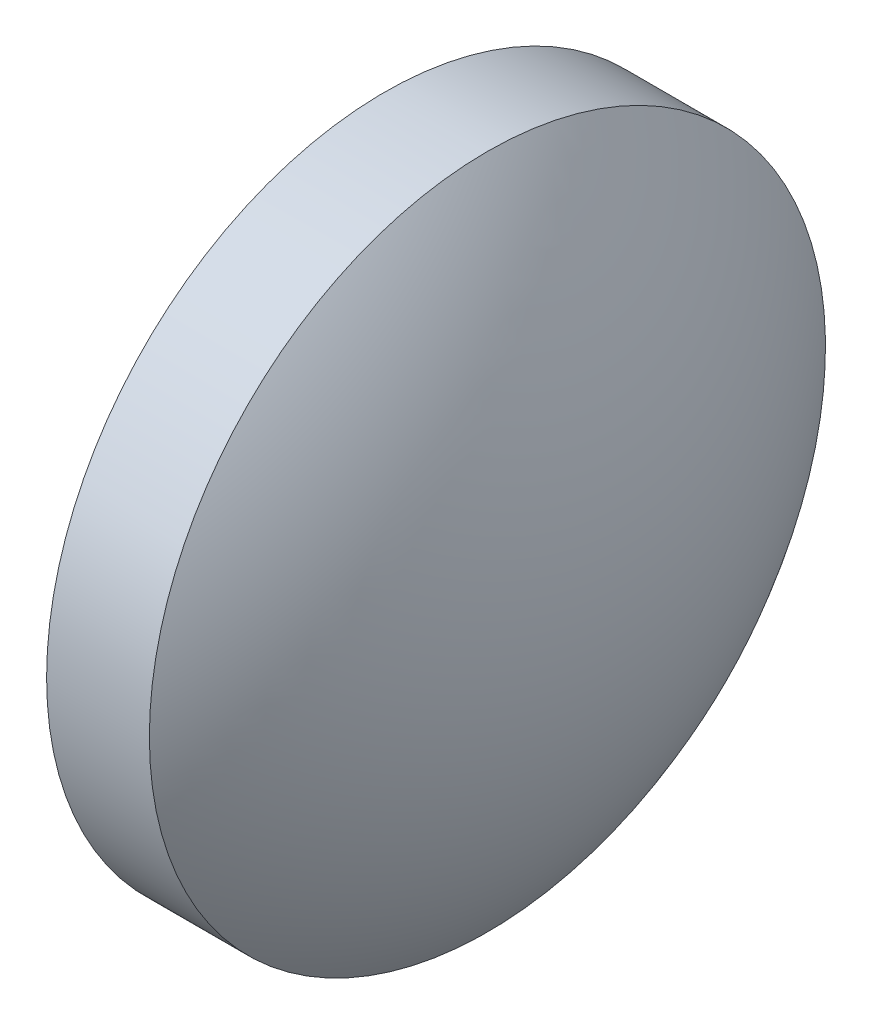
ISO-10303-21;
HEADER;
FILE_DESCRIPTION(('STEP AP214'),'2;1');
FILE_NAME('part.step','',(''),(''),'','','');
FILE_SCHEMA(('AUTOMOTIVE_DESIGN { 1 0 10303 214 1 1 1 1 }'));
ENDSEC;
DATA;
#1=APPLICATION_CONTEXT('core data for automotive mechanical design processes');
#2=APPLICATION_PROTOCOL_DEFINITION('international standard','automotive_design',2000,#1);
#3=PRODUCT_CONTEXT('',#1,'mechanical');
#4=PRODUCT('Part','Part','',(#3));
#5=PRODUCT_RELATED_PRODUCT_CATEGORY('part','',(#4));
#6=PRODUCT_DEFINITION_FORMATION('','',#4);
#7=PRODUCT_DEFINITION_CONTEXT('part definition',#1,'design');
#8=PRODUCT_DEFINITION('design','',#6,#7);
#9=PRODUCT_DEFINITION_SHAPE('','',#8);
#10=(LENGTH_UNIT() NAMED_UNIT(*) SI_UNIT(.MILLI.,.METRE.));
#11=(NAMED_UNIT(*) PLANE_ANGLE_UNIT() SI_UNIT($,.RADIAN.));
#12=(NAMED_UNIT(*) SI_UNIT($,.STERADIAN.) SOLID_ANGLE_UNIT());
#13=UNCERTAINTY_MEASURE_WITH_UNIT(LENGTH_MEASURE(1.E-05),#10,'distance_accuracy_value','');
#14=(GEOMETRIC_REPRESENTATION_CONTEXT(3) GLOBAL_UNCERTAINTY_ASSIGNED_CONTEXT((#13)) GLOBAL_UNIT_ASSIGNED_CONTEXT((#10,
#11,#12)) REPRESENTATION_CONTEXT('',''));
#15=CARTESIAN_POINT('',(0.,0.,0.));
#16=DIRECTION('',(0.,0.,1.));
#17=DIRECTION('',(1.,0.,0.));
#18=AXIS2_PLACEMENT_3D('',#15,#16,#17);
#19=CARTESIAN_POINT('',(548.627463267462,146.784706945377,0.));
#20=DIRECTION('',(-1.,0.,0.));
#21=DIRECTION('',(0.,1.,0.));
#22=AXIS2_PLACEMENT_3D('',#19,#20,#21);
#23=SPHERICAL_SURFACE('',#22,8.28047619047612);
#24=CARTESIAN_POINT('',(555.227939457938,146.784706945377,0.));
#25=DIRECTION('',(-1.,0.,0.));
#26=DIRECTION('',(0.,0.,1.));
#27=AXIS2_PLACEMENT_3D('',#24,#25,#26);
#28=CIRCLE('',#27,5.);
#29=CARTESIAN_POINT('',(555.227939457938,146.784706945377,5.));
#30=VERTEX_POINT('',#29);
#31=EDGE_CURVE('E10',#30,#30,#28,.T.);
#32=ORIENTED_EDGE('',*,*,#31,.F.);
#33=EDGE_LOOP('',(#32));
#34=FACE_BOUND('',#33,.T.);
#35=ADVANCED_FACE('F35',(#34),#23,.T.);
#36=CARTESIAN_POINT('',(552.766388986164,146.784706945377,0.));
#37=DIRECTION('',(-1.,0.,0.));
#38=DIRECTION('',(0.,0.,1.));
#39=AXIS2_PLACEMENT_3D('',#36,#37,#38);
#40=CYLINDRICAL_SURFACE('',#39,5.);
#41=CARTESIAN_POINT('',(553.707939457939,146.784706945377,0.));
#42=DIRECTION('',(-1.,0.,0.));
#43=DIRECTION('',(0.,0.,1.));
#44=AXIS2_PLACEMENT_3D('',#41,#42,#43);
#45=CIRCLE('',#44,5.);
#46=CARTESIAN_POINT('',(553.707939457939,146.784706945377,5.));
#47=VERTEX_POINT('',#46);
#48=EDGE_CURVE('E41',#47,#47,#45,.T.);
#49=ORIENTED_EDGE('',*,*,#48,.F.);
#50=EDGE_LOOP('',(#49));
#51=FACE_BOUND('',#50,.T.);
#52=ORIENTED_EDGE('',*,*,#31,.T.);
#53=EDGE_LOOP('',(#52));
#54=FACE_BOUND('',#53,.T.);
#55=ADVANCED_FACE('F49',(#51,#54),#40,.T.);
#56=CARTESIAN_POINT('',(553.707939457939,146.784706945377,0.));
#57=DIRECTION('',(1.,0.,0.));
#58=DIRECTION('',(0.,0.,-1.));
#59=AXIS2_PLACEMENT_3D('',#56,#57,#58);
#60=PLANE('',#59);
#61=ORIENTED_EDGE('',*,*,#48,.T.);
#62=EDGE_LOOP('',(#61));
#63=FACE_BOUND('',#62,.T.);
#64=ADVANCED_FACE('F47',(#63),#60,.F.);
#65=CLOSED_SHELL('',(#35,#55,#64));
#66=MANIFOLD_SOLID_BREP('B2',#65);
#67=ADVANCED_BREP_SHAPE_REPRESENTATION('',(#18,#66),#14);
#68=SHAPE_DEFINITION_REPRESENTATION(#9,#67);
ENDSEC;
END-ISO-10303-21;
